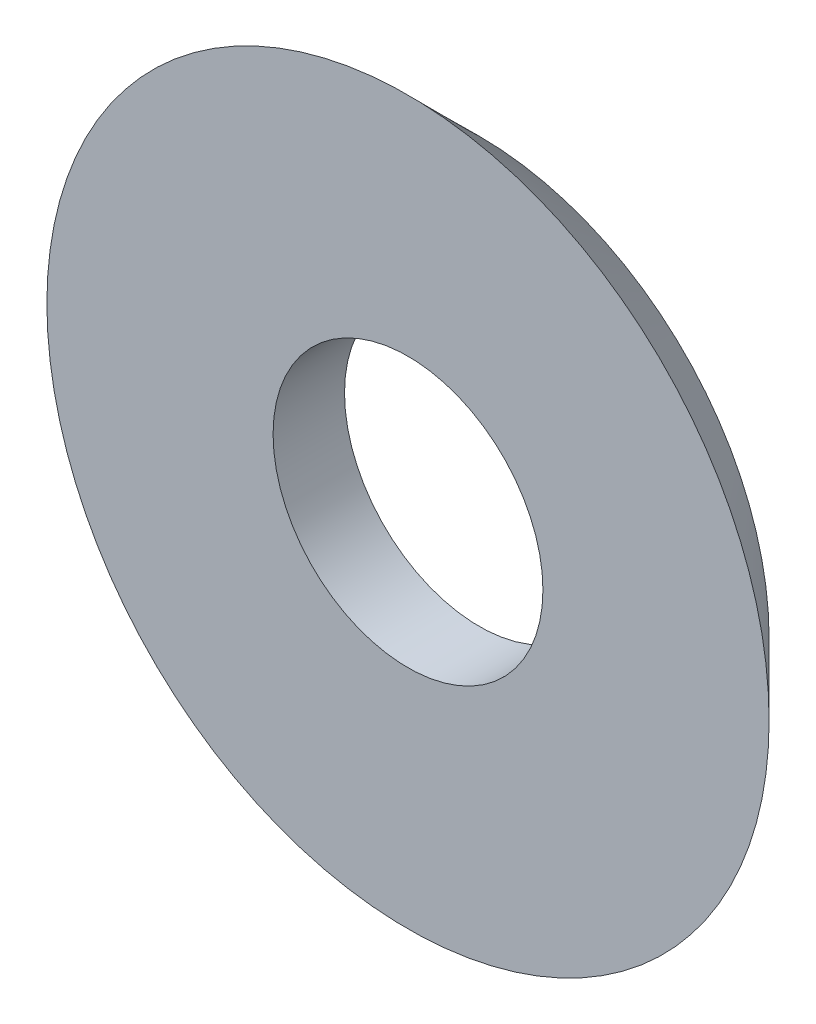
ISO-10303-21;
HEADER;
FILE_DESCRIPTION(('STEP AP214'),'2;1');
FILE_NAME('part.step','',(''),(''),'','','');
FILE_SCHEMA(('AUTOMOTIVE_DESIGN { 1 0 10303 214 1 1 1 1 }'));
ENDSEC;
DATA;
#1=APPLICATION_CONTEXT('core data for automotive mechanical design processes');
#2=APPLICATION_PROTOCOL_DEFINITION('international standard','automotive_design',2000,#1);
#3=PRODUCT_CONTEXT('',#1,'mechanical');
#4=PRODUCT('Part','Part','',(#3));
#5=PRODUCT_RELATED_PRODUCT_CATEGORY('part','',(#4));
#6=PRODUCT_DEFINITION_FORMATION('','',#4);
#7=PRODUCT_DEFINITION_CONTEXT('part definition',#1,'design');
#8=PRODUCT_DEFINITION('design','',#6,#7);
#9=PRODUCT_DEFINITION_SHAPE('','',#8);
#10=(LENGTH_UNIT() NAMED_UNIT(*) SI_UNIT(.MILLI.,.METRE.));
#11=(NAMED_UNIT(*) PLANE_ANGLE_UNIT() SI_UNIT($,.RADIAN.));
#12=(NAMED_UNIT(*) SI_UNIT($,.STERADIAN.) SOLID_ANGLE_UNIT());
#13=UNCERTAINTY_MEASURE_WITH_UNIT(LENGTH_MEASURE(1.E-05),#10,'distance_accuracy_value','');
#14=(GEOMETRIC_REPRESENTATION_CONTEXT(3) GLOBAL_UNCERTAINTY_ASSIGNED_CONTEXT((#13)) GLOBAL_UNIT_ASSIGNED_CONTEXT((#10,
#11,#12)) REPRESENTATION_CONTEXT('',''));
#15=CARTESIAN_POINT('',(0.,0.,0.));
#16=DIRECTION('',(0.,0.,1.));
#17=DIRECTION('',(1.,0.,0.));
#18=AXIS2_PLACEMENT_3D('',#15,#16,#17);
#19=CARTESIAN_POINT('',(0.,0.,-1.8));
#20=DIRECTION('',(0.,0.,1.));
#21=DIRECTION('',(1.,0.,0.));
#22=AXIS2_PLACEMENT_3D('',#19,#20,#21);
#23=PLANE('',#22);
#24=CARTESIAN_POINT('',(0.,0.,-1.8));
#25=DIRECTION('',(0.,0.,1.));
#26=DIRECTION('',(1.,0.,0.));
#27=AXIS2_PLACEMENT_3D('',#24,#25,#26);
#28=CIRCLE('',#27,7.3);
#29=CARTESIAN_POINT('',(7.3,0.,-1.8));
#30=VERTEX_POINT('',#29);
#31=EDGE_CURVE('E49',#30,#30,#28,.T.);
#32=ORIENTED_EDGE('',*,*,#31,.F.);
#33=EDGE_LOOP('',(#32));
#34=FACE_BOUND('',#33,.T.);
#35=CARTESIAN_POINT('',(0.,0.,-1.8));
#36=DIRECTION('',(0.,0.,1.));
#37=DIRECTION('',(1.,0.,0.));
#38=AXIS2_PLACEMENT_3D('',#35,#36,#37);
#39=CIRCLE('',#38,3.4);
#40=CARTESIAN_POINT('',(3.4,0.,-1.8));
#41=VERTEX_POINT('',#40);
#42=EDGE_CURVE('E10',#41,#41,#39,.T.);
#43=ORIENTED_EDGE('',*,*,#42,.T.);
#44=EDGE_LOOP('',(#43));
#45=FACE_BOUND('',#44,.T.);
#46=ADVANCED_FACE('F35',(#34,#45),#23,.F.);
#47=CARTESIAN_POINT('',(0.,0.,0.));
#48=DIRECTION('',(0.,0.,1.));
#49=DIRECTION('',(1.,0.,0.));
#50=AXIS2_PLACEMENT_3D('',#47,#48,#49);
#51=CYLINDRICAL_SURFACE('',#50,3.4);
#52=CARTESIAN_POINT('',(0.,0.,0.));
#53=DIRECTION('',(0.,0.,1.));
#54=DIRECTION('',(1.,0.,0.));
#55=AXIS2_PLACEMENT_3D('',#52,#53,#54);
#56=CIRCLE('',#55,3.4);
#57=CARTESIAN_POINT('',(3.4,0.,0.));
#58=VERTEX_POINT('',#57);
#59=EDGE_CURVE('E41',#58,#58,#56,.T.);
#60=ORIENTED_EDGE('',*,*,#59,.T.);
#61=EDGE_LOOP('',(#60));
#62=FACE_BOUND('',#61,.T.);
#63=ORIENTED_EDGE('',*,*,#42,.F.);
#64=EDGE_LOOP('',(#63));
#65=FACE_BOUND('',#64,.T.);
#66=ADVANCED_FACE('F59',(#62,#65),#51,.F.);
#67=CARTESIAN_POINT('',(0.,0.,0.));
#68=DIRECTION('',(0.,0.,1.));
#69=DIRECTION('',(1.,0.,0.));
#70=AXIS2_PLACEMENT_3D('',#67,#68,#69);
#71=PLANE('',#70);
#72=CARTESIAN_POINT('',(0.,0.,0.));
#73=DIRECTION('',(0.,0.,1.));
#74=DIRECTION('',(1.,0.,0.));
#75=AXIS2_PLACEMENT_3D('',#72,#73,#74);
#76=CIRCLE('',#75,9.10000000000002);
#77=CARTESIAN_POINT('',(9.10000000000002,0.,0.));
#78=VERTEX_POINT('',#77);
#79=EDGE_CURVE('E45',#78,#78,#76,.T.);
#80=ORIENTED_EDGE('',*,*,#79,.T.);
#81=EDGE_LOOP('',(#80));
#82=FACE_BOUND('',#81,.T.);
#83=ORIENTED_EDGE('',*,*,#59,.F.);
#84=EDGE_LOOP('',(#83));
#85=FACE_BOUND('',#84,.T.);
#86=ADVANCED_FACE('F63',(#82,#85),#71,.T.);
#87=CARTESIAN_POINT('',(0.,0.,0.));
#88=DIRECTION('',(0.,0.,1.));
#89=DIRECTION('',(1.,0.,0.));
#90=AXIS2_PLACEMENT_3D('',#87,#88,#89);
#91=CONICAL_SURFACE('',#90,9.10000000000002,0.785398163397454);
#92=ORIENTED_EDGE('',*,*,#31,.T.);
#93=EDGE_LOOP('',(#92));
#94=FACE_BOUND('',#93,.T.);
#95=ORIENTED_EDGE('',*,*,#79,.F.);
#96=EDGE_LOOP('',(#95));
#97=FACE_BOUND('',#96,.T.);
#98=ADVANCED_FACE('F55',(#94,#97),#91,.T.);
#99=CLOSED_SHELL('',(#46,#66,#86,#98));
#100=MANIFOLD_SOLID_BREP('B2',#99);
#101=ADVANCED_BREP_SHAPE_REPRESENTATION('',(#18,#100),#14);
#102=SHAPE_DEFINITION_REPRESENTATION(#9,#101);
ENDSEC;
END-ISO-10303-21;
